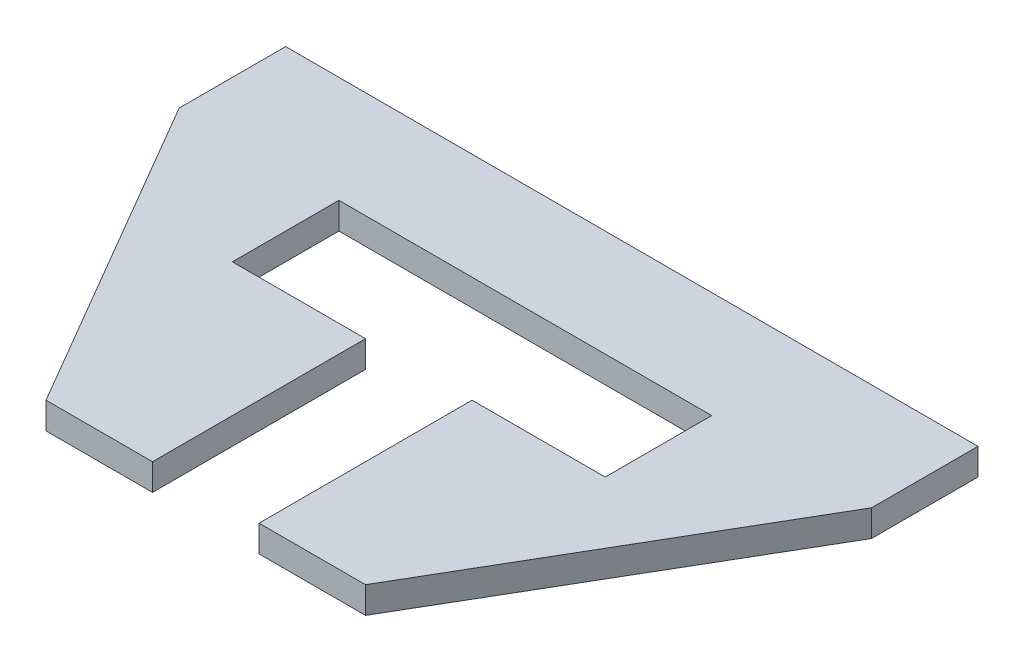
ISO-10303-21;
HEADER;
FILE_DESCRIPTION(('STEP AP214'),'2;1');
FILE_NAME('part.step','',(''),(''),'','','');
FILE_SCHEMA(('AUTOMOTIVE_DESIGN { 1 0 10303 214 1 1 1 1 }'));
ENDSEC;
DATA;
#1=APPLICATION_CONTEXT('core data for automotive mechanical design processes');
#2=APPLICATION_PROTOCOL_DEFINITION('international standard','automotive_design',2000,#1);
#3=PRODUCT_CONTEXT('',#1,'mechanical');
#4=PRODUCT('Part','Part','',(#3));
#5=PRODUCT_RELATED_PRODUCT_CATEGORY('part','',(#4));
#6=PRODUCT_DEFINITION_FORMATION('','',#4);
#7=PRODUCT_DEFINITION_CONTEXT('part definition',#1,'design');
#8=PRODUCT_DEFINITION('design','',#6,#7);
#9=PRODUCT_DEFINITION_SHAPE('','',#8);
#10=(LENGTH_UNIT() NAMED_UNIT(*) SI_UNIT(.MILLI.,.METRE.));
#11=(NAMED_UNIT(*) PLANE_ANGLE_UNIT() SI_UNIT($,.RADIAN.));
#12=(NAMED_UNIT(*) SI_UNIT($,.STERADIAN.) SOLID_ANGLE_UNIT());
#13=UNCERTAINTY_MEASURE_WITH_UNIT(LENGTH_MEASURE(1.E-05),#10,'distance_accuracy_value','');
#14=(GEOMETRIC_REPRESENTATION_CONTEXT(3) GLOBAL_UNCERTAINTY_ASSIGNED_CONTEXT((#13)) GLOBAL_UNIT_ASSIGNED_CONTEXT((#10,
#11,#12)) REPRESENTATION_CONTEXT('',''));
#15=CARTESIAN_POINT('',(0.,0.,0.));
#16=DIRECTION('',(0.,0.,1.));
#17=DIRECTION('',(1.,0.,0.));
#18=AXIS2_PLACEMENT_3D('',#15,#16,#17);
#19=CARTESIAN_POINT('',(-153.210638297872,6.35,28.5074468085107));
#20=DIRECTION('',(0.,0.,-1.));
#21=DIRECTION('',(-1.,0.,0.));
#22=AXIS2_PLACEMENT_3D('',#19,#20,#21);
#23=PLANE('',#22);
#24=DIRECTION('',(1.,0.,0.));
#25=VECTOR('',#24,1.);
#26=CARTESIAN_POINT('',(-153.210638297872,6.35,28.5074468085107));
#27=LINE('',#26,#25);
#28=CARTESIAN_POINT('',(-108.760638297872,6.35,28.5074468085107));
#29=VERTEX_POINT('',#28);
#30=CARTESIAN_POINT('',(-83.3606382978724,6.35,28.5074468085107));
#31=VERTEX_POINT('',#30);
#32=EDGE_CURVE('E176',#29,#31,#27,.T.);
#33=ORIENTED_EDGE('',*,*,#32,.F.);
#34=DIRECTION('',(0.,1.,0.));
#35=VECTOR('',#34,1.);
#36=CARTESIAN_POINT('',(-108.760638297872,0.,28.5074468085107));
#37=LINE('',#36,#35);
#38=CARTESIAN_POINT('',(-108.760638297872,0.,28.5074468085107));
#39=VERTEX_POINT('',#38);
#40=EDGE_CURVE('E211',#39,#29,#37,.T.);
#41=ORIENTED_EDGE('',*,*,#40,.F.);
#42=DIRECTION('',(1.,0.,0.));
#43=VECTOR('',#42,1.);
#44=CARTESIAN_POINT('',(-153.210638297872,0.,28.5074468085107));
#45=LINE('',#44,#43);
#46=CARTESIAN_POINT('',(-83.3606382978724,0.,28.5074468085107));
#47=VERTEX_POINT('',#46);
#48=EDGE_CURVE('E158',#39,#47,#45,.T.);
#49=ORIENTED_EDGE('',*,*,#48,.T.);
#50=DIRECTION('',(0.,1.,0.));
#51=VECTOR('',#50,1.);
#52=CARTESIAN_POINT('',(-83.3606382978724,0.,28.5074468085107));
#53=LINE('',#52,#51);
#54=EDGE_CURVE('E186',#47,#31,#53,.T.);
#55=ORIENTED_EDGE('',*,*,#54,.T.);
#56=EDGE_LOOP('',(#33,#41,#49,#55));
#57=FACE_BOUND('',#56,.T.);
#58=ADVANCED_FACE('F36',(#57),#23,.F.);
#59=CARTESIAN_POINT('',(-153.210638297872,6.35,-73.0925531914893));
#60=DIRECTION('',(1.,0.,0.));
#61=DIRECTION('',(0.,0.,-1.));
#62=AXIS2_PLACEMENT_3D('',#59,#60,#61);
#63=PLANE('',#62);
#64=DIRECTION('',(0.,0.,1.));
#65=VECTOR('',#64,1.);
#66=CARTESIAN_POINT('',(-153.210638297872,0.,-73.0925531914893));
#67=LINE('',#66,#65);
#68=CARTESIAN_POINT('',(-153.210638297872,0.,-73.0925531914893));
#69=VERTEX_POINT('',#68);
#70=CARTESIAN_POINT('',(-153.210638297872,0.,-47.6925531914895));
#71=VERTEX_POINT('',#70);
#72=EDGE_CURVE('E182',#69,#71,#67,.T.);
#73=ORIENTED_EDGE('',*,*,#72,.T.);
#74=DIRECTION('',(0.,1.,0.));
#75=VECTOR('',#74,1.);
#76=CARTESIAN_POINT('',(-153.210638297872,0.,-47.6925531914894));
#77=LINE('',#76,#75);
#78=CARTESIAN_POINT('',(-153.210638297872,6.35,-47.6925531914894));
#79=VERTEX_POINT('',#78);
#80=EDGE_CURVE('E59',#71,#79,#77,.T.);
#81=ORIENTED_EDGE('',*,*,#80,.T.);
#82=DIRECTION('',(0.,0.,1.));
#83=VECTOR('',#82,1.);
#84=CARTESIAN_POINT('',(-153.210638297872,6.35,-73.0925531914893));
#85=LINE('',#84,#83);
#86=CARTESIAN_POINT('',(-153.210638297872,6.35,-73.0925531914893));
#87=VERTEX_POINT('',#86);
#88=EDGE_CURVE('E160',#87,#79,#85,.T.);
#89=ORIENTED_EDGE('',*,*,#88,.F.);
#90=DIRECTION('',(0.,-1.,0.));
#91=VECTOR('',#90,1.);
#92=CARTESIAN_POINT('',(-153.210638297872,6.35,-73.0925531914893));
#93=LINE('',#92,#91);
#94=EDGE_CURVE('E166',#87,#69,#93,.T.);
#95=ORIENTED_EDGE('',*,*,#94,.T.);
#96=EDGE_LOOP('',(#73,#81,#89,#95));
#97=FACE_BOUND('',#96,.T.);
#98=ADVANCED_FACE('F38',(#97),#63,.F.);
#99=CARTESIAN_POINT('',(-57.9606382978724,0.,28.5074468085107));
#100=VERTEX_POINT('',#99);
#101=CARTESIAN_POINT('',(-32.5606382978724,0.,28.5074468085107));
#102=VERTEX_POINT('',#101);
#103=EDGE_CURVE('E162',#100,#102,#45,.T.);
#104=ORIENTED_EDGE('',*,*,#103,.T.);
#105=DIRECTION('',(0.,1.,0.));
#106=VECTOR('',#105,1.);
#107=CARTESIAN_POINT('',(-32.5606382978723,0.,28.5074468085107));
#108=LINE('',#107,#106);
#109=CARTESIAN_POINT('',(-32.5606382978723,6.35,28.5074468085107));
#110=VERTEX_POINT('',#109);
#111=EDGE_CURVE('E51',#102,#110,#108,.T.);
#112=ORIENTED_EDGE('',*,*,#111,.T.);
#113=CARTESIAN_POINT('',(-57.9606382978724,6.35,28.5074468085107));
#114=VERTEX_POINT('',#113);
#115=EDGE_CURVE('E179',#114,#110,#27,.T.);
#116=ORIENTED_EDGE('',*,*,#115,.F.);
#117=DIRECTION('',(0.,1.,0.));
#118=VECTOR('',#117,1.);
#119=CARTESIAN_POINT('',(-57.9606382978724,0.,28.5074468085107));
#120=LINE('',#119,#118);
#121=EDGE_CURVE('E184',#100,#114,#120,.T.);
#122=ORIENTED_EDGE('',*,*,#121,.F.);
#123=EDGE_LOOP('',(#104,#112,#116,#122));
#124=FACE_BOUND('',#123,.T.);
#125=ADVANCED_FACE('F204',(#124),#23,.F.);
#126=CARTESIAN_POINT('',(11.8893617021276,6.35,-73.0925531914893));
#127=DIRECTION('',(1.,0.,0.));
#128=DIRECTION('',(0.,0.,-1.));
#129=AXIS2_PLACEMENT_3D('',#126,#127,#128);
#130=PLANE('',#129);
#131=DIRECTION('',(0.,1.,0.));
#132=VECTOR('',#131,1.);
#133=CARTESIAN_POINT('',(11.8893617021276,0.,-47.6925531914894));
#134=LINE('',#133,#132);
#135=CARTESIAN_POINT('',(11.8893617021276,0.,-47.6925531914894));
#136=VERTEX_POINT('',#135);
#137=CARTESIAN_POINT('',(11.8893617021276,6.35,-47.6925531914894));
#138=VERTEX_POINT('',#137);
#139=EDGE_CURVE('E137',#136,#138,#134,.T.);
#140=ORIENTED_EDGE('',*,*,#139,.F.);
#141=DIRECTION('',(0.,0.,1.));
#142=VECTOR('',#141,1.);
#143=CARTESIAN_POINT('',(11.8893617021276,0.,-73.0925531914893));
#144=LINE('',#143,#142);
#145=CARTESIAN_POINT('',(11.8893617021276,0.,-73.0925531914893));
#146=VERTEX_POINT('',#145);
#147=EDGE_CURVE('E149',#146,#136,#144,.T.);
#148=ORIENTED_EDGE('',*,*,#147,.F.);
#149=DIRECTION('',(0.,-1.,0.));
#150=VECTOR('',#149,1.);
#151=CARTESIAN_POINT('',(11.8893617021276,6.35,-73.0925531914893));
#152=LINE('',#151,#150);
#153=CARTESIAN_POINT('',(11.8893617021276,6.35,-73.0925531914893));
#154=VERTEX_POINT('',#153);
#155=EDGE_CURVE('E44',#154,#146,#152,.T.);
#156=ORIENTED_EDGE('',*,*,#155,.F.);
#157=DIRECTION('',(0.,0.,1.));
#158=VECTOR('',#157,1.);
#159=CARTESIAN_POINT('',(11.8893617021276,6.35,-73.0925531914893));
#160=LINE('',#159,#158);
#161=EDGE_CURVE('E152',#154,#138,#160,.T.);
#162=ORIENTED_EDGE('',*,*,#161,.T.);
#163=EDGE_LOOP('',(#140,#148,#156,#162));
#164=FACE_BOUND('',#163,.T.);
#165=ADVANCED_FACE('F148',(#164),#130,.T.);
#166=CARTESIAN_POINT('',(-153.210638297872,6.35,-73.0925531914893));
#167=DIRECTION('',(0.,0.,-1.));
#168=DIRECTION('',(-1.,0.,0.));
#169=AXIS2_PLACEMENT_3D('',#166,#167,#168);
#170=PLANE('',#169);
#171=DIRECTION('',(1.,0.,0.));
#172=VECTOR('',#171,1.);
#173=CARTESIAN_POINT('',(-153.210638297872,0.,-73.0925531914893));
#174=LINE('',#173,#172);
#175=EDGE_CURVE('E157',#69,#146,#174,.T.);
#176=ORIENTED_EDGE('',*,*,#175,.F.);
#177=ORIENTED_EDGE('',*,*,#94,.F.);
#178=DIRECTION('',(1.,0.,0.));
#179=VECTOR('',#178,1.);
#180=CARTESIAN_POINT('',(-153.210638297872,6.35,-73.0925531914893));
#181=LINE('',#180,#179);
#182=EDGE_CURVE('E167',#87,#154,#181,.T.);
#183=ORIENTED_EDGE('',*,*,#182,.T.);
#184=ORIENTED_EDGE('',*,*,#155,.T.);
#185=EDGE_LOOP('',(#176,#177,#183,#184));
#186=FACE_BOUND('',#185,.T.);
#187=ADVANCED_FACE('F170',(#186),#170,.T.);
#188=CARTESIAN_POINT('',(0.,6.35,0.));
#189=DIRECTION('',(0.,1.,0.));
#190=DIRECTION('',(0.,0.,1.));
#191=AXIS2_PLACEMENT_3D('',#188,#189,#190);
#192=PLANE('',#191);
#193=DIRECTION('',(-0.503871025524086,0.,0.863778900898434));
#194=VECTOR('',#193,1.);
#195=CARTESIAN_POINT('',(11.8893617021276,6.35,-47.6925531914894));
#196=LINE('',#195,#194);
#197=EDGE_CURVE('E143',#138,#110,#196,.T.);
#198=ORIENTED_EDGE('',*,*,#197,.F.);
#199=ORIENTED_EDGE('',*,*,#161,.F.);
#200=ORIENTED_EDGE('',*,*,#182,.F.);
#201=ORIENTED_EDGE('',*,*,#88,.T.);
#202=DIRECTION('',(-0.503871025524086,0.,-0.863778900898434));
#203=VECTOR('',#202,1.);
#204=CARTESIAN_POINT('',(-108.760638297872,6.35,28.5074468085107));
#205=LINE('',#204,#203);
#206=EDGE_CURVE('E205',#29,#79,#205,.T.);
#207=ORIENTED_EDGE('',*,*,#206,.F.);
#208=ORIENTED_EDGE('',*,*,#32,.T.);
#209=DIRECTION('',(0.,0.,1.));
#210=VECTOR('',#209,1.);
#211=CARTESIAN_POINT('',(-83.3606382978724,6.35,28.5074468085107));
#212=LINE('',#211,#210);
#213=CARTESIAN_POINT('',(-83.3606382978724,6.35,-22.2925531914893));
#214=VERTEX_POINT('',#213);
#215=EDGE_CURVE('E248',#214,#31,#212,.T.);
#216=ORIENTED_EDGE('',*,*,#215,.F.);
#217=DIRECTION('',(1.,0.,0.));
#218=VECTOR('',#217,1.);
#219=CARTESIAN_POINT('',(-115.110638297872,6.35,-22.2925531914893));
#220=LINE('',#219,#218);
#221=CARTESIAN_POINT('',(-115.110638297872,6.35,-22.2925531914893));
#222=VERTEX_POINT('',#221);
#223=EDGE_CURVE('E231',#222,#214,#220,.T.);
#224=ORIENTED_EDGE('',*,*,#223,.F.);
#225=DIRECTION('',(0.,0.,1.));
#226=VECTOR('',#225,1.);
#227=CARTESIAN_POINT('',(-115.110638297872,6.35,-47.6925531914893));
#228=LINE('',#227,#226);
#229=CARTESIAN_POINT('',(-115.110638297872,6.35,-47.6925531914893));
#230=VERTEX_POINT('',#229);
#231=EDGE_CURVE('E214',#230,#222,#228,.T.);
#232=ORIENTED_EDGE('',*,*,#231,.F.);
#233=DIRECTION('',(-1.,0.,0.));
#234=VECTOR('',#233,1.);
#235=CARTESIAN_POINT('',(-83.3606382978724,6.35,-47.6925531914894));
#236=LINE('',#235,#234);
#237=CARTESIAN_POINT('',(-26.2106382978724,6.35,-47.6925531914893));
#238=VERTEX_POINT('',#237);
#239=EDGE_CURVE('E196',#238,#230,#236,.T.);
#240=ORIENTED_EDGE('',*,*,#239,.F.);
#241=DIRECTION('',(0.,0.,-1.));
#242=VECTOR('',#241,1.);
#243=CARTESIAN_POINT('',(-26.2106382978724,6.35,-47.6925531914893));
#244=LINE('',#243,#242);
#245=CARTESIAN_POINT('',(-26.2106382978724,6.35,-22.2925531914893));
#246=VERTEX_POINT('',#245);
#247=EDGE_CURVE('E220',#246,#238,#244,.T.);
#248=ORIENTED_EDGE('',*,*,#247,.F.);
#249=CARTESIAN_POINT('',(-57.9606382978724,6.35,-22.2925531914893));
#250=VERTEX_POINT('',#249);
#251=EDGE_CURVE('E230',#250,#246,#220,.T.);
#252=ORIENTED_EDGE('',*,*,#251,.F.);
#253=DIRECTION('',(0.,0.,-1.));
#254=VECTOR('',#253,1.);
#255=CARTESIAN_POINT('',(-57.9606382978724,6.35,28.5074468085107));
#256=LINE('',#255,#254);
#257=EDGE_CURVE('E202',#114,#250,#256,.T.);
#258=ORIENTED_EDGE('',*,*,#257,.F.);
#259=ORIENTED_EDGE('',*,*,#115,.T.);
#260=EDGE_LOOP('',(#198,#199,#200,#201,#207,#208,#216,#224,#232,#240,#248,#252,#258,#259));
#261=FACE_BOUND('',#260,.T.);
#262=ADVANCED_FACE('F173',(#261),#192,.T.);
#263=CARTESIAN_POINT('',(0.,0.,0.));
#264=DIRECTION('',(0.,1.,0.));
#265=DIRECTION('',(0.,0.,1.));
#266=AXIS2_PLACEMENT_3D('',#263,#264,#265);
#267=PLANE('',#266);
#268=ORIENTED_EDGE('',*,*,#147,.T.);
#269=DIRECTION('',(-0.503871025524086,0.,0.863778900898434));
#270=VECTOR('',#269,1.);
#271=CARTESIAN_POINT('',(11.8893617021276,0.,-47.6925531914894));
#272=LINE('',#271,#270);
#273=EDGE_CURVE('E134',#136,#102,#272,.T.);
#274=ORIENTED_EDGE('',*,*,#273,.T.);
#275=ORIENTED_EDGE('',*,*,#103,.F.);
#276=DIRECTION('',(0.,0.,-1.));
#277=VECTOR('',#276,1.);
#278=CARTESIAN_POINT('',(-57.9606382978724,0.,28.5074468085107));
#279=LINE('',#278,#277);
#280=CARTESIAN_POINT('',(-57.9606382978724,0.,-22.2925531914893));
#281=VERTEX_POINT('',#280);
#282=EDGE_CURVE('E252',#100,#281,#279,.T.);
#283=ORIENTED_EDGE('',*,*,#282,.T.);
#284=DIRECTION('',(1.,0.,0.));
#285=VECTOR('',#284,1.);
#286=CARTESIAN_POINT('',(-115.110638297872,0.,-22.2925531914893));
#287=LINE('',#286,#285);
#288=CARTESIAN_POINT('',(-26.2106382978724,0.,-22.2925531914893));
#289=VERTEX_POINT('',#288);
#290=EDGE_CURVE('E219',#281,#289,#287,.T.);
#291=ORIENTED_EDGE('',*,*,#290,.T.);
#292=DIRECTION('',(0.,0.,-1.));
#293=VECTOR('',#292,1.);
#294=CARTESIAN_POINT('',(-26.2106382978724,0.,-47.6925531914893));
#295=LINE('',#294,#293);
#296=CARTESIAN_POINT('',(-26.2106382978724,0.,-47.6925531914893));
#297=VERTEX_POINT('',#296);
#298=EDGE_CURVE('E224',#289,#297,#295,.T.);
#299=ORIENTED_EDGE('',*,*,#298,.T.);
#300=DIRECTION('',(-1.,0.,0.));
#301=VECTOR('',#300,1.);
#302=CARTESIAN_POINT('',(-83.3606382978724,0.,-47.6925531914894));
#303=LINE('',#302,#301);
#304=CARTESIAN_POINT('',(-115.110638297872,0.,-47.6925531914893));
#305=VERTEX_POINT('',#304);
#306=EDGE_CURVE('E193',#297,#305,#303,.T.);
#307=ORIENTED_EDGE('',*,*,#306,.T.);
#308=DIRECTION('',(0.,0.,1.));
#309=VECTOR('',#308,1.);
#310=CARTESIAN_POINT('',(-115.110638297872,0.,-47.6925531914893));
#311=LINE('',#310,#309);
#312=CARTESIAN_POINT('',(-115.110638297872,0.,-22.2925531914893));
#313=VERTEX_POINT('',#312);
#314=EDGE_CURVE('E216',#305,#313,#311,.T.);
#315=ORIENTED_EDGE('',*,*,#314,.T.);
#316=CARTESIAN_POINT('',(-83.3606382978724,0.,-22.2925531914893));
#317=VERTEX_POINT('',#316);
#318=EDGE_CURVE('E221',#313,#317,#287,.T.);
#319=ORIENTED_EDGE('',*,*,#318,.T.);
#320=DIRECTION('',(0.,0.,1.));
#321=VECTOR('',#320,1.);
#322=CARTESIAN_POINT('',(-83.3606382978724,0.,28.5074468085107));
#323=LINE('',#322,#321);
#324=EDGE_CURVE('E249',#317,#47,#323,.T.);
#325=ORIENTED_EDGE('',*,*,#324,.T.);
#326=ORIENTED_EDGE('',*,*,#48,.F.);
#327=DIRECTION('',(-0.503871025524086,0.,-0.863778900898434));
#328=VECTOR('',#327,1.);
#329=CARTESIAN_POINT('',(-108.760638297872,0.,28.5074468085107));
#330=LINE('',#329,#328);
#331=EDGE_CURVE('E207',#39,#71,#330,.T.);
#332=ORIENTED_EDGE('',*,*,#331,.T.);
#333=ORIENTED_EDGE('',*,*,#72,.F.);
#334=ORIENTED_EDGE('',*,*,#175,.T.);
#335=EDGE_LOOP('',(#268,#274,#275,#283,#291,#299,#307,#315,#319,#325,#326,#332,#333,#334));
#336=FACE_BOUND('',#335,.T.);
#337=ADVANCED_FACE('F154',(#336),#267,.F.);
#338=CARTESIAN_POINT('',(-83.3606382978724,0.,28.5074468085107));
#339=DIRECTION('',(-1.,0.,0.));
#340=DIRECTION('',(0.,0.,1.));
#341=AXIS2_PLACEMENT_3D('',#338,#339,#340);
#342=PLANE('',#341);
#343=ORIENTED_EDGE('',*,*,#324,.F.);
#344=DIRECTION('',(0.,1.,0.));
#345=VECTOR('',#344,1.);
#346=CARTESIAN_POINT('',(-83.3606382978724,0.,-22.2925531914893));
#347=LINE('',#346,#345);
#348=EDGE_CURVE('E238',#317,#214,#347,.T.);
#349=ORIENTED_EDGE('',*,*,#348,.T.);
#350=ORIENTED_EDGE('',*,*,#215,.T.);
#351=ORIENTED_EDGE('',*,*,#54,.F.);
#352=EDGE_LOOP('',(#343,#349,#350,#351));
#353=FACE_BOUND('',#352,.T.);
#354=ADVANCED_FACE('F273',(#353),#342,.F.);
#355=CARTESIAN_POINT('',(-83.3606382978724,0.,-47.6925531914894));
#356=DIRECTION('',(0.,0.,-1.));
#357=DIRECTION('',(-1.,0.,0.));
#358=AXIS2_PLACEMENT_3D('',#355,#356,#357);
#359=PLANE('',#358);
#360=ORIENTED_EDGE('',*,*,#239,.T.);
#361=DIRECTION('',(0.,1.,0.));
#362=VECTOR('',#361,1.);
#363=CARTESIAN_POINT('',(-115.110638297872,0.,-47.6925531914893));
#364=LINE('',#363,#362);
#365=EDGE_CURVE('E235',#305,#230,#364,.T.);
#366=ORIENTED_EDGE('',*,*,#365,.F.);
#367=ORIENTED_EDGE('',*,*,#306,.F.);
#368=DIRECTION('',(0.,1.,0.));
#369=VECTOR('',#368,1.);
#370=CARTESIAN_POINT('',(-26.2106382978724,0.,-47.6925531914893));
#371=LINE('',#370,#369);
#372=EDGE_CURVE('E239',#297,#238,#371,.T.);
#373=ORIENTED_EDGE('',*,*,#372,.T.);
#374=EDGE_LOOP('',(#360,#366,#367,#373));
#375=FACE_BOUND('',#374,.T.);
#376=ADVANCED_FACE('F259',(#375),#359,.F.);
#377=CARTESIAN_POINT('',(-57.9606382978724,0.,28.5074468085107));
#378=DIRECTION('',(1.,0.,0.));
#379=DIRECTION('',(0.,0.,-1.));
#380=AXIS2_PLACEMENT_3D('',#377,#378,#379);
#381=PLANE('',#380);
#382=ORIENTED_EDGE('',*,*,#257,.T.);
#383=DIRECTION('',(0.,-1.,0.));
#384=VECTOR('',#383,1.);
#385=CARTESIAN_POINT('',(-57.9606382978724,0.,-22.2925531914893));
#386=LINE('',#385,#384);
#387=EDGE_CURVE('E11',#250,#281,#386,.T.);
#388=ORIENTED_EDGE('',*,*,#387,.T.);
#389=ORIENTED_EDGE('',*,*,#282,.F.);
#390=ORIENTED_EDGE('',*,*,#121,.T.);
#391=EDGE_LOOP('',(#382,#388,#389,#390));
#392=FACE_BOUND('',#391,.T.);
#393=ADVANCED_FACE('F282',(#392),#381,.F.);
#394=CARTESIAN_POINT('',(-115.110638297872,0.,-22.2925531914893));
#395=DIRECTION('',(0.,0.,1.));
#396=DIRECTION('',(1.,0.,0.));
#397=AXIS2_PLACEMENT_3D('',#394,#395,#396);
#398=PLANE('',#397);
#399=ORIENTED_EDGE('',*,*,#251,.T.);
#400=DIRECTION('',(0.,1.,0.));
#401=VECTOR('',#400,1.);
#402=CARTESIAN_POINT('',(-26.2106382978724,0.,-22.2925531914893));
#403=LINE('',#402,#401);
#404=EDGE_CURVE('E242',#289,#246,#403,.T.);
#405=ORIENTED_EDGE('',*,*,#404,.F.);
#406=ORIENTED_EDGE('',*,*,#290,.F.);
#407=ORIENTED_EDGE('',*,*,#387,.F.);
#408=EDGE_LOOP('',(#399,#405,#406,#407));
#409=FACE_BOUND('',#408,.T.);
#410=ADVANCED_FACE('F281',(#409),#398,.F.);
#411=CARTESIAN_POINT('',(-26.2106382978724,0.,-47.6925531914893));
#412=DIRECTION('',(1.,0.,0.));
#413=DIRECTION('',(0.,0.,-1.));
#414=AXIS2_PLACEMENT_3D('',#411,#412,#413);
#415=PLANE('',#414);
#416=ORIENTED_EDGE('',*,*,#247,.T.);
#417=ORIENTED_EDGE('',*,*,#372,.F.);
#418=ORIENTED_EDGE('',*,*,#298,.F.);
#419=ORIENTED_EDGE('',*,*,#404,.T.);
#420=EDGE_LOOP('',(#416,#417,#418,#419));
#421=FACE_BOUND('',#420,.T.);
#422=ADVANCED_FACE('F279',(#421),#415,.F.);
#423=ORIENTED_EDGE('',*,*,#318,.F.);
#424=DIRECTION('',(0.,1.,0.));
#425=VECTOR('',#424,1.);
#426=CARTESIAN_POINT('',(-115.110638297872,0.,-22.2925531914893));
#427=LINE('',#426,#425);
#428=EDGE_CURVE('E227',#313,#222,#427,.T.);
#429=ORIENTED_EDGE('',*,*,#428,.T.);
#430=ORIENTED_EDGE('',*,*,#223,.T.);
#431=ORIENTED_EDGE('',*,*,#348,.F.);
#432=EDGE_LOOP('',(#423,#429,#430,#431));
#433=FACE_BOUND('',#432,.T.);
#434=ADVANCED_FACE('F270',(#433),#398,.F.);
#435=CARTESIAN_POINT('',(-115.110638297872,0.,-47.6925531914893));
#436=DIRECTION('',(-1.,0.,0.));
#437=DIRECTION('',(0.,0.,1.));
#438=AXIS2_PLACEMENT_3D('',#435,#436,#437);
#439=PLANE('',#438);
#440=ORIENTED_EDGE('',*,*,#231,.T.);
#441=ORIENTED_EDGE('',*,*,#428,.F.);
#442=ORIENTED_EDGE('',*,*,#314,.F.);
#443=ORIENTED_EDGE('',*,*,#365,.T.);
#444=EDGE_LOOP('',(#440,#441,#442,#443));
#445=FACE_BOUND('',#444,.T.);
#446=ADVANCED_FACE('F265',(#445),#439,.F.);
#447=CARTESIAN_POINT('',(-108.760638297872,0.,28.5074468085107));
#448=DIRECTION('',(0.863778900898433,0.,-0.503871025524086));
#449=DIRECTION('',(-0.503871025524086,0.,-0.863778900898434));
#450=AXIS2_PLACEMENT_3D('',#447,#448,#449);
#451=PLANE('',#450);
#452=ORIENTED_EDGE('',*,*,#206,.T.);
#453=ORIENTED_EDGE('',*,*,#80,.F.);
#454=ORIENTED_EDGE('',*,*,#331,.F.);
#455=ORIENTED_EDGE('',*,*,#40,.T.);
#456=EDGE_LOOP('',(#452,#453,#454,#455));
#457=FACE_BOUND('',#456,.T.);
#458=ADVANCED_FACE('F355',(#457),#451,.F.);
#459=CARTESIAN_POINT('',(11.8893617021276,0.,-47.6925531914894));
#460=DIRECTION('',(-0.863778900898433,0.,-0.503871025524086));
#461=DIRECTION('',(-0.503871025524086,0.,0.863778900898434));
#462=AXIS2_PLACEMENT_3D('',#459,#460,#461);
#463=PLANE('',#462);
#464=ORIENTED_EDGE('',*,*,#197,.T.);
#465=ORIENTED_EDGE('',*,*,#111,.F.);
#466=ORIENTED_EDGE('',*,*,#273,.F.);
#467=ORIENTED_EDGE('',*,*,#139,.T.);
#468=EDGE_LOOP('',(#464,#465,#466,#467));
#469=FACE_BOUND('',#468,.T.);
#470=ADVANCED_FACE('F136',(#469),#463,.F.);
#471=CLOSED_SHELL('',(#58,#98,#125,#165,#187,#262,#337,#354,#376,#393,#410,#422,#434,#446,#458,#470));
#472=MANIFOLD_SOLID_BREP('B2',#471);
#473=ADVANCED_BREP_SHAPE_REPRESENTATION('',(#18,#472),#14);
#474=SHAPE_DEFINITION_REPRESENTATION(#9,#473);
ENDSEC;
END-ISO-10303-21;
